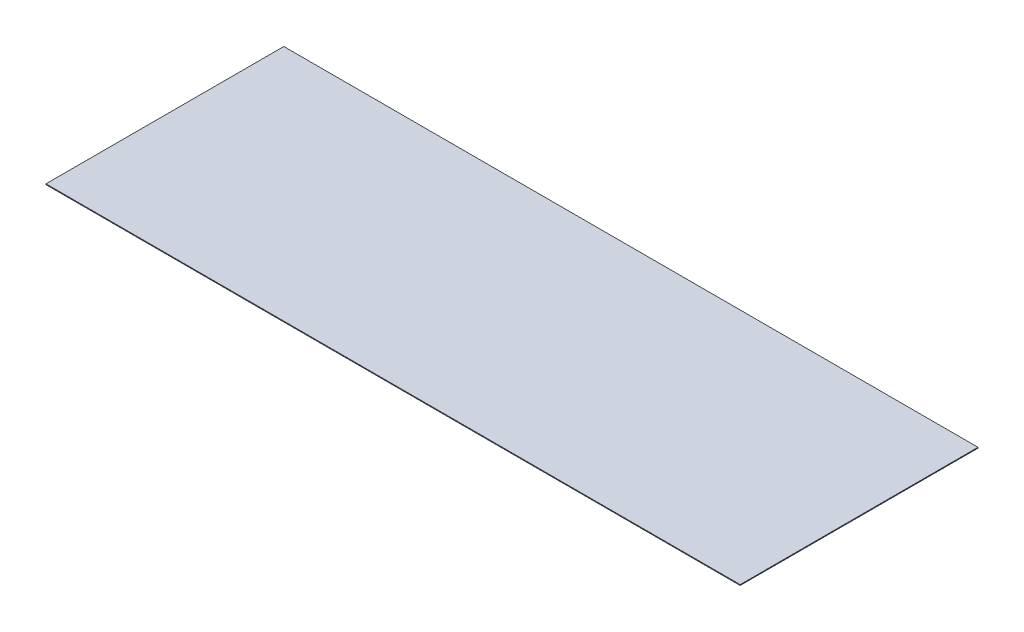
ISO-10303-21;
HEADER;
FILE_DESCRIPTION(('STEP AP214'),'2;1');
FILE_NAME('part.step','',(''),(''),'','','');
FILE_SCHEMA(('AUTOMOTIVE_DESIGN { 1 0 10303 214 1 1 1 1 }'));
ENDSEC;
DATA;
#1=APPLICATION_CONTEXT('core data for automotive mechanical design processes');
#2=APPLICATION_PROTOCOL_DEFINITION('international standard','automotive_design',2000,#1);
#3=PRODUCT_CONTEXT('',#1,'mechanical');
#4=PRODUCT('Part','Part','',(#3));
#5=PRODUCT_RELATED_PRODUCT_CATEGORY('part','',(#4));
#6=PRODUCT_DEFINITION_FORMATION('','',#4);
#7=PRODUCT_DEFINITION_CONTEXT('part definition',#1,'design');
#8=PRODUCT_DEFINITION('design','',#6,#7);
#9=PRODUCT_DEFINITION_SHAPE('','',#8);
#10=(LENGTH_UNIT() NAMED_UNIT(*) SI_UNIT(.MILLI.,.METRE.));
#11=(NAMED_UNIT(*) PLANE_ANGLE_UNIT() SI_UNIT($,.RADIAN.));
#12=(NAMED_UNIT(*) SI_UNIT($,.STERADIAN.) SOLID_ANGLE_UNIT());
#13=UNCERTAINTY_MEASURE_WITH_UNIT(LENGTH_MEASURE(1.E-05),#10,'distance_accuracy_value','');
#14=(GEOMETRIC_REPRESENTATION_CONTEXT(3) GLOBAL_UNCERTAINTY_ASSIGNED_CONTEXT((#13)) GLOBAL_UNIT_ASSIGNED_CONTEXT((#10,
#11,#12)) REPRESENTATION_CONTEXT('',''));
#15=CARTESIAN_POINT('',(0.,0.,0.));
#16=DIRECTION('',(0.,0.,1.));
#17=DIRECTION('',(1.,0.,0.));
#18=AXIS2_PLACEMENT_3D('',#15,#16,#17);
#19=CARTESIAN_POINT('',(437.843,1.,-150.));
#20=DIRECTION('',(-1.,0.,0.));
#21=DIRECTION('',(0.,0.,1.));
#22=AXIS2_PLACEMENT_3D('',#19,#20,#21);
#23=PLANE('',#22);
#24=DIRECTION('',(0.,0.,-1.));
#25=VECTOR('',#24,1.);
#26=CARTESIAN_POINT('',(437.843,0.,-150.));
#27=LINE('',#26,#25);
#28=CARTESIAN_POINT('',(437.843,0.,150.));
#29=VERTEX_POINT('',#28);
#30=CARTESIAN_POINT('',(437.843,0.,-150.));
#31=VERTEX_POINT('',#30);
#32=EDGE_CURVE('E96',#29,#31,#27,.T.);
#33=ORIENTED_EDGE('',*,*,#32,.T.);
#34=DIRECTION('',(0.,-1.,0.));
#35=VECTOR('',#34,1.);
#36=CARTESIAN_POINT('',(437.843,1.,-150.));
#37=LINE('',#36,#35);
#38=CARTESIAN_POINT('',(437.843,1.,-150.));
#39=VERTEX_POINT('',#38);
#40=EDGE_CURVE('E11',#39,#31,#37,.T.);
#41=ORIENTED_EDGE('',*,*,#40,.F.);
#42=DIRECTION('',(0.,0.,-1.));
#43=VECTOR('',#42,1.);
#44=CARTESIAN_POINT('',(437.843,1.,-150.));
#45=LINE('',#44,#43);
#46=CARTESIAN_POINT('',(437.843,1.,150.));
#47=VERTEX_POINT('',#46);
#48=EDGE_CURVE('E84',#47,#39,#45,.T.);
#49=ORIENTED_EDGE('',*,*,#48,.F.);
#50=DIRECTION('',(0.,-1.,0.));
#51=VECTOR('',#50,1.);
#52=CARTESIAN_POINT('',(437.843,1.,150.));
#53=LINE('',#52,#51);
#54=EDGE_CURVE('E92',#47,#29,#53,.T.);
#55=ORIENTED_EDGE('',*,*,#54,.T.);
#56=EDGE_LOOP('',(#33,#41,#49,#55));
#57=FACE_BOUND('',#56,.T.);
#58=ADVANCED_FACE('F33',(#57),#23,.F.);
#59=CARTESIAN_POINT('',(-437.843,1.,-150.));
#60=DIRECTION('',(0.,0.,1.));
#61=DIRECTION('',(1.,0.,0.));
#62=AXIS2_PLACEMENT_3D('',#59,#60,#61);
#63=PLANE('',#62);
#64=DIRECTION('',(-1.,0.,0.));
#65=VECTOR('',#64,1.);
#66=CARTESIAN_POINT('',(-437.843,0.,-150.));
#67=LINE('',#66,#65);
#68=CARTESIAN_POINT('',(-437.843,0.,-150.));
#69=VERTEX_POINT('',#68);
#70=EDGE_CURVE('E88',#31,#69,#67,.T.);
#71=ORIENTED_EDGE('',*,*,#70,.T.);
#72=DIRECTION('',(0.,-1.,0.));
#73=VECTOR('',#72,1.);
#74=CARTESIAN_POINT('',(-437.843,1.,-150.));
#75=LINE('',#74,#73);
#76=CARTESIAN_POINT('',(-437.843,1.,-150.));
#77=VERTEX_POINT('',#76);
#78=EDGE_CURVE('E41',#77,#69,#75,.T.);
#79=ORIENTED_EDGE('',*,*,#78,.F.);
#80=DIRECTION('',(-1.,0.,0.));
#81=VECTOR('',#80,1.);
#82=CARTESIAN_POINT('',(-437.843,1.,-150.));
#83=LINE('',#82,#81);
#84=EDGE_CURVE('E79',#39,#77,#83,.T.);
#85=ORIENTED_EDGE('',*,*,#84,.F.);
#86=ORIENTED_EDGE('',*,*,#40,.T.);
#87=EDGE_LOOP('',(#71,#79,#85,#86));
#88=FACE_BOUND('',#87,.T.);
#89=ADVANCED_FACE('F87',(#88),#63,.F.);
#90=CARTESIAN_POINT('',(-437.843,1.,-150.));
#91=DIRECTION('',(1.,0.,0.));
#92=DIRECTION('',(0.,0.,-1.));
#93=AXIS2_PLACEMENT_3D('',#90,#91,#92);
#94=PLANE('',#93);
#95=DIRECTION('',(0.,0.,1.));
#96=VECTOR('',#95,1.);
#97=CARTESIAN_POINT('',(-437.843,0.,-150.));
#98=LINE('',#97,#96);
#99=CARTESIAN_POINT('',(-437.843,0.,150.));
#100=VERTEX_POINT('',#99);
#101=EDGE_CURVE('E66',#69,#100,#98,.T.);
#102=ORIENTED_EDGE('',*,*,#101,.T.);
#103=DIRECTION('',(0.,-1.,0.));
#104=VECTOR('',#103,1.);
#105=CARTESIAN_POINT('',(-437.843,1.,150.));
#106=LINE('',#105,#104);
#107=CARTESIAN_POINT('',(-437.843,1.,150.));
#108=VERTEX_POINT('',#107);
#109=EDGE_CURVE('E89',#108,#100,#106,.T.);
#110=ORIENTED_EDGE('',*,*,#109,.F.);
#111=DIRECTION('',(0.,0.,1.));
#112=VECTOR('',#111,1.);
#113=CARTESIAN_POINT('',(-437.843,1.,-150.));
#114=LINE('',#113,#112);
#115=EDGE_CURVE('E82',#77,#108,#114,.T.);
#116=ORIENTED_EDGE('',*,*,#115,.F.);
#117=ORIENTED_EDGE('',*,*,#78,.T.);
#118=EDGE_LOOP('',(#102,#110,#116,#117));
#119=FACE_BOUND('',#118,.T.);
#120=ADVANCED_FACE('F90',(#119),#94,.F.);
#121=CARTESIAN_POINT('',(-437.843,1.,150.));
#122=DIRECTION('',(0.,0.,-1.));
#123=DIRECTION('',(-1.,0.,0.));
#124=AXIS2_PLACEMENT_3D('',#121,#122,#123);
#125=PLANE('',#124);
#126=DIRECTION('',(1.,0.,0.));
#127=VECTOR('',#126,1.);
#128=CARTESIAN_POINT('',(-437.843,0.,150.));
#129=LINE('',#128,#127);
#130=EDGE_CURVE('E72',#100,#29,#129,.T.);
#131=ORIENTED_EDGE('',*,*,#130,.T.);
#132=ORIENTED_EDGE('',*,*,#54,.F.);
#133=DIRECTION('',(1.,0.,0.));
#134=VECTOR('',#133,1.);
#135=CARTESIAN_POINT('',(-437.843,1.,150.));
#136=LINE('',#135,#134);
#137=EDGE_CURVE('E49',#108,#47,#136,.T.);
#138=ORIENTED_EDGE('',*,*,#137,.F.);
#139=ORIENTED_EDGE('',*,*,#109,.T.);
#140=EDGE_LOOP('',(#131,#132,#138,#139));
#141=FACE_BOUND('',#140,.T.);
#142=ADVANCED_FACE('F103',(#141),#125,.F.);
#143=CARTESIAN_POINT('',(0.,1.,0.));
#144=DIRECTION('',(0.,1.,0.));
#145=DIRECTION('',(0.,0.,1.));
#146=AXIS2_PLACEMENT_3D('',#143,#144,#145);
#147=PLANE('',#146);
#148=ORIENTED_EDGE('',*,*,#48,.T.);
#149=ORIENTED_EDGE('',*,*,#84,.T.);
#150=ORIENTED_EDGE('',*,*,#115,.T.);
#151=ORIENTED_EDGE('',*,*,#137,.T.);
#152=EDGE_LOOP('',(#148,#149,#150,#151));
#153=FACE_BOUND('',#152,.T.);
#154=ADVANCED_FACE('F80',(#153),#147,.T.);
#155=CARTESIAN_POINT('',(0.,0.,0.));
#156=DIRECTION('',(0.,1.,0.));
#157=DIRECTION('',(0.,0.,1.));
#158=AXIS2_PLACEMENT_3D('',#155,#156,#157);
#159=PLANE('',#158);
#160=ORIENTED_EDGE('',*,*,#32,.F.);
#161=ORIENTED_EDGE('',*,*,#130,.F.);
#162=ORIENTED_EDGE('',*,*,#101,.F.);
#163=ORIENTED_EDGE('',*,*,#70,.F.);
#164=EDGE_LOOP('',(#160,#161,#162,#163));
#165=FACE_BOUND('',#164,.T.);
#166=ADVANCED_FACE('F106',(#165),#159,.F.);
#167=CLOSED_SHELL('',(#58,#89,#120,#142,#154,#166));
#168=MANIFOLD_SOLID_BREP('B2',#167);
#169=ADVANCED_BREP_SHAPE_REPRESENTATION('',(#18,#168),#14);
#170=SHAPE_DEFINITION_REPRESENTATION(#9,#169);
ENDSEC;
END-ISO-10303-21;
